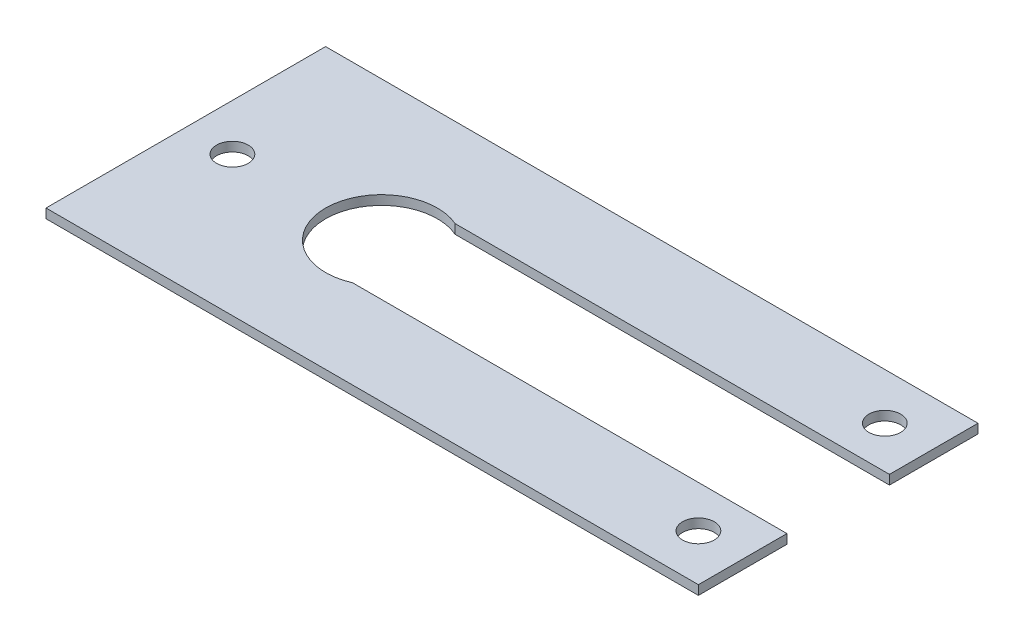
ISO-10303-21;
HEADER;
FILE_DESCRIPTION(('STEP AP214'),'2;1');
FILE_NAME('part.step','',(''),(''),'','','');
FILE_SCHEMA(('AUTOMOTIVE_DESIGN { 1 0 10303 214 1 1 1 1 }'));
ENDSEC;
DATA;
#1=APPLICATION_CONTEXT('core data for automotive mechanical design processes');
#2=APPLICATION_PROTOCOL_DEFINITION('international standard','automotive_design',2000,#1);
#3=PRODUCT_CONTEXT('',#1,'mechanical');
#4=PRODUCT('Part','Part','',(#3));
#5=PRODUCT_RELATED_PRODUCT_CATEGORY('part','',(#4));
#6=PRODUCT_DEFINITION_FORMATION('','',#4);
#7=PRODUCT_DEFINITION_CONTEXT('part definition',#1,'design');
#8=PRODUCT_DEFINITION('design','',#6,#7);
#9=PRODUCT_DEFINITION_SHAPE('','',#8);
#10=(LENGTH_UNIT() NAMED_UNIT(*) SI_UNIT(.MILLI.,.METRE.));
#11=(NAMED_UNIT(*) PLANE_ANGLE_UNIT() SI_UNIT($,.RADIAN.));
#12=(NAMED_UNIT(*) SI_UNIT($,.STERADIAN.) SOLID_ANGLE_UNIT());
#13=UNCERTAINTY_MEASURE_WITH_UNIT(LENGTH_MEASURE(1.E-05),#10,'distance_accuracy_value','');
#14=(GEOMETRIC_REPRESENTATION_CONTEXT(3) GLOBAL_UNCERTAINTY_ASSIGNED_CONTEXT((#13)) GLOBAL_UNIT_ASSIGNED_CONTEXT((#10,
#11,#12)) REPRESENTATION_CONTEXT('',''));
#15=CARTESIAN_POINT('',(0.,0.,0.));
#16=DIRECTION('',(0.,0.,1.));
#17=DIRECTION('',(1.,0.,0.));
#18=AXIS2_PLACEMENT_3D('',#15,#16,#17);
#19=CARTESIAN_POINT('',(35.,-1.,-5.5));
#20=DIRECTION('',(1.,0.,0.));
#21=DIRECTION('',(0.,0.,-1.));
#22=AXIS2_PLACEMENT_3D('',#19,#20,#21);
#23=PLANE('',#22);
#24=DIRECTION('',(0.,0.,-1.));
#25=VECTOR('',#24,1.);
#26=CARTESIAN_POINT('',(35.,0.,-5.5));
#27=LINE('',#26,#25);
#28=CARTESIAN_POINT('',(35.,0.,-5.5));
#29=VERTEX_POINT('',#28);
#30=CARTESIAN_POINT('',(35.,0.,-15.));
#31=VERTEX_POINT('',#30);
#32=EDGE_CURVE('E148',#29,#31,#27,.T.);
#33=ORIENTED_EDGE('',*,*,#32,.F.);
#34=DIRECTION('',(0.,1.,0.));
#35=VECTOR('',#34,1.);
#36=CARTESIAN_POINT('',(35.,-1.,-5.5));
#37=LINE('',#36,#35);
#38=CARTESIAN_POINT('',(35.,-1.,-5.5));
#39=VERTEX_POINT('',#38);
#40=EDGE_CURVE('E11',#39,#29,#37,.T.);
#41=ORIENTED_EDGE('',*,*,#40,.F.);
#42=DIRECTION('',(0.,0.,-1.));
#43=VECTOR('',#42,1.);
#44=CARTESIAN_POINT('',(35.,-1.,-5.5));
#45=LINE('',#44,#43);
#46=CARTESIAN_POINT('',(35.,-1.,-15.));
#47=VERTEX_POINT('',#46);
#48=EDGE_CURVE('E177',#39,#47,#45,.T.);
#49=ORIENTED_EDGE('',*,*,#48,.T.);
#50=DIRECTION('',(0.,1.,0.));
#51=VECTOR('',#50,1.);
#52=CARTESIAN_POINT('',(35.,-1.,-15.));
#53=LINE('',#52,#51);
#54=EDGE_CURVE('E48',#47,#31,#53,.T.);
#55=ORIENTED_EDGE('',*,*,#54,.T.);
#56=EDGE_LOOP('',(#33,#41,#49,#55));
#57=FACE_BOUND('',#56,.T.);
#58=ADVANCED_FACE('F45',(#57),#23,.T.);
#59=CARTESIAN_POINT('',(-11.6020842383436,-1.,-5.5));
#60=DIRECTION('',(0.,0.,1.));
#61=DIRECTION('',(1.,0.,0.));
#62=AXIS2_PLACEMENT_3D('',#59,#60,#61);
#63=PLANE('',#62);
#64=DIRECTION('',(1.,0.,0.));
#65=VECTOR('',#64,1.);
#66=CARTESIAN_POINT('',(-11.6020842383436,0.,-5.5));
#67=LINE('',#66,#65);
#68=CARTESIAN_POINT('',(-11.6020842383436,0.,-5.5));
#69=VERTEX_POINT('',#68);
#70=EDGE_CURVE('E174',#69,#29,#67,.T.);
#71=ORIENTED_EDGE('',*,*,#70,.F.);
#72=DIRECTION('',(0.,1.,0.));
#73=VECTOR('',#72,1.);
#74=CARTESIAN_POINT('',(-11.6020842383436,-1.,-5.5));
#75=LINE('',#74,#73);
#76=CARTESIAN_POINT('',(-11.6020842383436,-1.,-5.5));
#77=VERTEX_POINT('',#76);
#78=EDGE_CURVE('E55',#77,#69,#75,.T.);
#79=ORIENTED_EDGE('',*,*,#78,.F.);
#80=DIRECTION('',(1.,0.,0.));
#81=VECTOR('',#80,1.);
#82=CARTESIAN_POINT('',(-11.6020842383436,-1.,-5.5));
#83=LINE('',#82,#81);
#84=EDGE_CURVE('E134',#77,#39,#83,.T.);
#85=ORIENTED_EDGE('',*,*,#84,.T.);
#86=ORIENTED_EDGE('',*,*,#40,.T.);
#87=EDGE_LOOP('',(#71,#79,#85,#86));
#88=FACE_BOUND('',#87,.T.);
#89=ADVANCED_FACE('F195',(#88),#63,.T.);
#90=CARTESIAN_POINT('',(-14.,-1.,0.));
#91=DIRECTION('',(0.,1.,0.));
#92=DIRECTION('',(0.,0.,1.));
#93=AXIS2_PLACEMENT_3D('',#90,#91,#92);
#94=CYLINDRICAL_SURFACE('',#93,6.);
#95=CARTESIAN_POINT('',(-14.,0.,0.));
#96=DIRECTION('',(0.,-1.,0.));
#97=DIRECTION('',(0.,0.,1.));
#98=AXIS2_PLACEMENT_3D('',#95,#96,#97);
#99=CIRCLE('',#98,6.);
#100=CARTESIAN_POINT('',(-11.6020842383436,0.,5.5));
#101=VERTEX_POINT('',#100);
#102=EDGE_CURVE('E120',#101,#69,#99,.T.);
#103=ORIENTED_EDGE('',*,*,#102,.F.);
#104=DIRECTION('',(0.,1.,0.));
#105=VECTOR('',#104,1.);
#106=CARTESIAN_POINT('',(-11.6020842383436,-1.,5.5));
#107=LINE('',#106,#105);
#108=CARTESIAN_POINT('',(-11.6020842383436,-1.,5.5));
#109=VERTEX_POINT('',#108);
#110=EDGE_CURVE('E115',#109,#101,#107,.T.);
#111=ORIENTED_EDGE('',*,*,#110,.F.);
#112=CARTESIAN_POINT('',(-14.,-1.,0.));
#113=DIRECTION('',(0.,-1.,0.));
#114=DIRECTION('',(0.,0.,1.));
#115=AXIS2_PLACEMENT_3D('',#112,#113,#114);
#116=CIRCLE('',#115,6.);
#117=EDGE_CURVE('E118',#109,#77,#116,.T.);
#118=ORIENTED_EDGE('',*,*,#117,.T.);
#119=ORIENTED_EDGE('',*,*,#78,.T.);
#120=EDGE_LOOP('',(#103,#111,#118,#119));
#121=FACE_BOUND('',#120,.T.);
#122=ADVANCED_FACE('F117',(#121),#94,.F.);
#123=CARTESIAN_POINT('',(-11.6020842383436,-1.,5.5));
#124=DIRECTION('',(0.,0.,-1.));
#125=DIRECTION('',(-1.,0.,0.));
#126=AXIS2_PLACEMENT_3D('',#123,#124,#125);
#127=PLANE('',#126);
#128=DIRECTION('',(-1.,0.,0.));
#129=VECTOR('',#128,1.);
#130=CARTESIAN_POINT('',(-11.6020842383436,0.,5.5));
#131=LINE('',#130,#129);
#132=CARTESIAN_POINT('',(35.,0.,5.5));
#133=VERTEX_POINT('',#132);
#134=EDGE_CURVE('E169',#133,#101,#131,.T.);
#135=ORIENTED_EDGE('',*,*,#134,.F.);
#136=DIRECTION('',(0.,1.,0.));
#137=VECTOR('',#136,1.);
#138=CARTESIAN_POINT('',(35.,-1.,5.5));
#139=LINE('',#138,#137);
#140=CARTESIAN_POINT('',(35.,-1.,5.5));
#141=VERTEX_POINT('',#140);
#142=EDGE_CURVE('E126',#141,#133,#139,.T.);
#143=ORIENTED_EDGE('',*,*,#142,.F.);
#144=DIRECTION('',(-1.,0.,0.));
#145=VECTOR('',#144,1.);
#146=CARTESIAN_POINT('',(-11.6020842383436,-1.,5.5));
#147=LINE('',#146,#145);
#148=EDGE_CURVE('E132',#141,#109,#147,.T.);
#149=ORIENTED_EDGE('',*,*,#148,.T.);
#150=ORIENTED_EDGE('',*,*,#110,.T.);
#151=EDGE_LOOP('',(#135,#143,#149,#150));
#152=FACE_BOUND('',#151,.T.);
#153=ADVANCED_FACE('F137',(#152),#127,.T.);
#154=CARTESIAN_POINT('',(35.,-1.,15.));
#155=DIRECTION('',(1.,0.,0.));
#156=DIRECTION('',(0.,0.,-1.));
#157=AXIS2_PLACEMENT_3D('',#154,#155,#156);
#158=PLANE('',#157);
#159=DIRECTION('',(0.,0.,-1.));
#160=VECTOR('',#159,1.);
#161=CARTESIAN_POINT('',(35.,0.,15.));
#162=LINE('',#161,#160);
#163=CARTESIAN_POINT('',(35.,0.,15.));
#164=VERTEX_POINT('',#163);
#165=EDGE_CURVE('E165',#164,#133,#162,.T.);
#166=ORIENTED_EDGE('',*,*,#165,.F.);
#167=DIRECTION('',(0.,1.,0.));
#168=VECTOR('',#167,1.);
#169=CARTESIAN_POINT('',(35.,-1.,15.));
#170=LINE('',#169,#168);
#171=CARTESIAN_POINT('',(35.,-1.,15.));
#172=VERTEX_POINT('',#171);
#173=EDGE_CURVE('E183',#172,#164,#170,.T.);
#174=ORIENTED_EDGE('',*,*,#173,.F.);
#175=DIRECTION('',(0.,0.,-1.));
#176=VECTOR('',#175,1.);
#177=CARTESIAN_POINT('',(35.,-1.,15.));
#178=LINE('',#177,#176);
#179=EDGE_CURVE('E139',#172,#141,#178,.T.);
#180=ORIENTED_EDGE('',*,*,#179,.T.);
#181=ORIENTED_EDGE('',*,*,#142,.T.);
#182=EDGE_LOOP('',(#166,#174,#180,#181));
#183=FACE_BOUND('',#182,.T.);
#184=ADVANCED_FACE('F208',(#183),#158,.T.);
#185=CARTESIAN_POINT('',(-35.,-1.,15.));
#186=DIRECTION('',(0.,0.,1.));
#187=DIRECTION('',(1.,0.,0.));
#188=AXIS2_PLACEMENT_3D('',#185,#186,#187);
#189=PLANE('',#188);
#190=DIRECTION('',(1.,0.,0.));
#191=VECTOR('',#190,1.);
#192=CARTESIAN_POINT('',(-35.,0.,15.));
#193=LINE('',#192,#191);
#194=CARTESIAN_POINT('',(-35.,0.,15.));
#195=VERTEX_POINT('',#194);
#196=EDGE_CURVE('E161',#195,#164,#193,.T.);
#197=ORIENTED_EDGE('',*,*,#196,.F.);
#198=DIRECTION('',(0.,1.,0.));
#199=VECTOR('',#198,1.);
#200=CARTESIAN_POINT('',(-35.,-1.,15.));
#201=LINE('',#200,#199);
#202=CARTESIAN_POINT('',(-35.,-1.,15.));
#203=VERTEX_POINT('',#202);
#204=EDGE_CURVE('E186',#203,#195,#201,.T.);
#205=ORIENTED_EDGE('',*,*,#204,.F.);
#206=DIRECTION('',(1.,0.,0.));
#207=VECTOR('',#206,1.);
#208=CARTESIAN_POINT('',(-35.,-1.,15.));
#209=LINE('',#208,#207);
#210=EDGE_CURVE('E142',#203,#172,#209,.T.);
#211=ORIENTED_EDGE('',*,*,#210,.T.);
#212=ORIENTED_EDGE('',*,*,#173,.T.);
#213=EDGE_LOOP('',(#197,#205,#211,#212));
#214=FACE_BOUND('',#213,.T.);
#215=ADVANCED_FACE('F211',(#214),#189,.T.);
#216=CARTESIAN_POINT('',(-35.,-1.,15.));
#217=DIRECTION('',(-1.,0.,0.));
#218=DIRECTION('',(0.,0.,1.));
#219=AXIS2_PLACEMENT_3D('',#216,#217,#218);
#220=PLANE('',#219);
#221=DIRECTION('',(0.,0.,1.));
#222=VECTOR('',#221,1.);
#223=CARTESIAN_POINT('',(-35.,0.,15.));
#224=LINE('',#223,#222);
#225=CARTESIAN_POINT('',(-35.,0.,-15.));
#226=VERTEX_POINT('',#225);
#227=EDGE_CURVE('E157',#226,#195,#224,.T.);
#228=ORIENTED_EDGE('',*,*,#227,.F.);
#229=DIRECTION('',(0.,1.,0.));
#230=VECTOR('',#229,1.);
#231=CARTESIAN_POINT('',(-35.,-1.,-15.));
#232=LINE('',#231,#230);
#233=CARTESIAN_POINT('',(-35.,-1.,-15.));
#234=VERTEX_POINT('',#233);
#235=EDGE_CURVE('E188',#234,#226,#232,.T.);
#236=ORIENTED_EDGE('',*,*,#235,.F.);
#237=DIRECTION('',(0.,0.,1.));
#238=VECTOR('',#237,1.);
#239=CARTESIAN_POINT('',(-35.,-1.,15.));
#240=LINE('',#239,#238);
#241=EDGE_CURVE('E275',#234,#203,#240,.T.);
#242=ORIENTED_EDGE('',*,*,#241,.T.);
#243=ORIENTED_EDGE('',*,*,#204,.T.);
#244=EDGE_LOOP('',(#228,#236,#242,#243));
#245=FACE_BOUND('',#244,.T.);
#246=ADVANCED_FACE('F215',(#245),#220,.T.);
#247=CARTESIAN_POINT('',(-35.,-1.,-15.));
#248=DIRECTION('',(0.,0.,-1.));
#249=DIRECTION('',(-1.,0.,0.));
#250=AXIS2_PLACEMENT_3D('',#247,#248,#249);
#251=PLANE('',#250);
#252=DIRECTION('',(-1.,0.,0.));
#253=VECTOR('',#252,1.);
#254=CARTESIAN_POINT('',(-35.,0.,-15.));
#255=LINE('',#254,#253);
#256=EDGE_CURVE('E152',#31,#226,#255,.T.);
#257=ORIENTED_EDGE('',*,*,#256,.F.);
#258=ORIENTED_EDGE('',*,*,#54,.F.);
#259=DIRECTION('',(-1.,0.,0.));
#260=VECTOR('',#259,1.);
#261=CARTESIAN_POINT('',(-35.,-1.,-15.));
#262=LINE('',#261,#260);
#263=EDGE_CURVE('E272',#47,#234,#262,.T.);
#264=ORIENTED_EDGE('',*,*,#263,.T.);
#265=ORIENTED_EDGE('',*,*,#235,.T.);
#266=EDGE_LOOP('',(#257,#258,#264,#265));
#267=FACE_BOUND('',#266,.T.);
#268=ADVANCED_FACE('F192',(#267),#251,.T.);
#269=CARTESIAN_POINT('',(-14.,-1.,0.));
#270=DIRECTION('',(0.,1.,0.));
#271=DIRECTION('',(0.,0.,1.));
#272=AXIS2_PLACEMENT_3D('',#269,#270,#271);
#273=PLANE('',#272);
#274=CARTESIAN_POINT('',(30.,-1.,10.));
#275=DIRECTION('',(0.,1.,0.));
#276=DIRECTION('',(0.,0.,-1.));
#277=AXIS2_PLACEMENT_3D('',#274,#275,#276);
#278=CIRCLE('',#277,1.7);
#279=CARTESIAN_POINT('',(30.,-1.,8.3));
#280=VERTEX_POINT('',#279);
#281=EDGE_CURVE('E246',#280,#280,#278,.T.);
#282=ORIENTED_EDGE('',*,*,#281,.T.);
#283=EDGE_LOOP('',(#282));
#284=FACE_BOUND('',#283,.T.);
#285=CARTESIAN_POINT('',(-30.,-1.,0.));
#286=DIRECTION('',(0.,1.,0.));
#287=DIRECTION('',(0.,0.,1.));
#288=AXIS2_PLACEMENT_3D('',#285,#286,#287);
#289=CIRCLE('',#288,1.7);
#290=CARTESIAN_POINT('',(-30.,-1.,1.7));
#291=VERTEX_POINT('',#290);
#292=EDGE_CURVE('E256',#291,#291,#289,.T.);
#293=ORIENTED_EDGE('',*,*,#292,.T.);
#294=EDGE_LOOP('',(#293));
#295=FACE_BOUND('',#294,.T.);
#296=CARTESIAN_POINT('',(30.,-1.,-10.));
#297=DIRECTION('',(0.,1.,0.));
#298=DIRECTION('',(0.,0.,1.));
#299=AXIS2_PLACEMENT_3D('',#296,#297,#298);
#300=CIRCLE('',#299,1.7);
#301=CARTESIAN_POINT('',(30.,-1.,-8.3));
#302=VERTEX_POINT('',#301);
#303=EDGE_CURVE('E153',#302,#302,#300,.T.);
#304=ORIENTED_EDGE('',*,*,#303,.T.);
#305=EDGE_LOOP('',(#304));
#306=FACE_BOUND('',#305,.T.);
#307=ORIENTED_EDGE('',*,*,#48,.F.);
#308=ORIENTED_EDGE('',*,*,#84,.F.);
#309=ORIENTED_EDGE('',*,*,#117,.F.);
#310=ORIENTED_EDGE('',*,*,#148,.F.);
#311=ORIENTED_EDGE('',*,*,#179,.F.);
#312=ORIENTED_EDGE('',*,*,#210,.F.);
#313=ORIENTED_EDGE('',*,*,#241,.F.);
#314=ORIENTED_EDGE('',*,*,#263,.F.);
#315=EDGE_LOOP('',(#307,#308,#309,#310,#311,#312,#313,#314));
#316=FACE_BOUND('',#315,.T.);
#317=ADVANCED_FACE('F130',(#284,#295,#306,#316),#273,.F.);
#318=CARTESIAN_POINT('',(-14.,0.,0.));
#319=DIRECTION('',(0.,1.,0.));
#320=DIRECTION('',(0.,0.,1.));
#321=AXIS2_PLACEMENT_3D('',#318,#319,#320);
#322=PLANE('',#321);
#323=CARTESIAN_POINT('',(30.,0.,10.));
#324=DIRECTION('',(0.,1.,0.));
#325=DIRECTION('',(0.,0.,-1.));
#326=AXIS2_PLACEMENT_3D('',#323,#324,#325);
#327=CIRCLE('',#326,1.7);
#328=CARTESIAN_POINT('',(30.,0.,8.3));
#329=VERTEX_POINT('',#328);
#330=EDGE_CURVE('E249',#329,#329,#327,.T.);
#331=ORIENTED_EDGE('',*,*,#330,.F.);
#332=EDGE_LOOP('',(#331));
#333=FACE_BOUND('',#332,.T.);
#334=CARTESIAN_POINT('',(-30.,0.,0.));
#335=DIRECTION('',(0.,1.,0.));
#336=DIRECTION('',(0.,0.,1.));
#337=AXIS2_PLACEMENT_3D('',#334,#335,#336);
#338=CIRCLE('',#337,1.7);
#339=CARTESIAN_POINT('',(-30.,0.,1.7));
#340=VERTEX_POINT('',#339);
#341=EDGE_CURVE('E253',#340,#340,#338,.T.);
#342=ORIENTED_EDGE('',*,*,#341,.F.);
#343=EDGE_LOOP('',(#342));
#344=FACE_BOUND('',#343,.T.);
#345=CARTESIAN_POINT('',(30.,0.,-10.));
#346=DIRECTION('',(0.,1.,0.));
#347=DIRECTION('',(0.,0.,1.));
#348=AXIS2_PLACEMENT_3D('',#345,#346,#347);
#349=CIRCLE('',#348,1.7);
#350=CARTESIAN_POINT('',(30.,0.,-8.3));
#351=VERTEX_POINT('',#350);
#352=EDGE_CURVE('E260',#351,#351,#349,.T.);
#353=ORIENTED_EDGE('',*,*,#352,.F.);
#354=EDGE_LOOP('',(#353));
#355=FACE_BOUND('',#354,.T.);
#356=ORIENTED_EDGE('',*,*,#32,.T.);
#357=ORIENTED_EDGE('',*,*,#256,.T.);
#358=ORIENTED_EDGE('',*,*,#227,.T.);
#359=ORIENTED_EDGE('',*,*,#196,.T.);
#360=ORIENTED_EDGE('',*,*,#165,.T.);
#361=ORIENTED_EDGE('',*,*,#134,.T.);
#362=ORIENTED_EDGE('',*,*,#102,.T.);
#363=ORIENTED_EDGE('',*,*,#70,.T.);
#364=EDGE_LOOP('',(#356,#357,#358,#359,#360,#361,#362,#363));
#365=FACE_BOUND('',#364,.T.);
#366=ADVANCED_FACE('F194',(#333,#344,#355,#365),#322,.T.);
#367=CARTESIAN_POINT('',(30.,-1.,-10.));
#368=DIRECTION('',(0.,1.,0.));
#369=DIRECTION('',(0.,0.,1.));
#370=AXIS2_PLACEMENT_3D('',#367,#368,#369);
#371=CYLINDRICAL_SURFACE('',#370,1.7);
#372=ORIENTED_EDGE('',*,*,#303,.F.);
#373=EDGE_LOOP('',(#372));
#374=FACE_BOUND('',#373,.T.);
#375=ORIENTED_EDGE('',*,*,#352,.T.);
#376=EDGE_LOOP('',(#375));
#377=FACE_BOUND('',#376,.T.);
#378=ADVANCED_FACE('F227',(#374,#377),#371,.F.);
#379=CARTESIAN_POINT('',(-30.,-1.,0.));
#380=DIRECTION('',(0.,1.,0.));
#381=DIRECTION('',(0.,0.,1.));
#382=AXIS2_PLACEMENT_3D('',#379,#380,#381);
#383=CYLINDRICAL_SURFACE('',#382,1.7);
#384=ORIENTED_EDGE('',*,*,#292,.F.);
#385=EDGE_LOOP('',(#384));
#386=FACE_BOUND('',#385,.T.);
#387=ORIENTED_EDGE('',*,*,#341,.T.);
#388=EDGE_LOOP('',(#387));
#389=FACE_BOUND('',#388,.T.);
#390=ADVANCED_FACE('F234',(#386,#389),#383,.F.);
#391=CARTESIAN_POINT('',(30.,-1.,10.));
#392=DIRECTION('',(0.,1.,0.));
#393=DIRECTION('',(0.,0.,1.));
#394=AXIS2_PLACEMENT_3D('',#391,#392,#393);
#395=CYLINDRICAL_SURFACE('',#394,1.7);
#396=ORIENTED_EDGE('',*,*,#281,.F.);
#397=EDGE_LOOP('',(#396));
#398=FACE_BOUND('',#397,.T.);
#399=ORIENTED_EDGE('',*,*,#330,.T.);
#400=EDGE_LOOP('',(#399));
#401=FACE_BOUND('',#400,.T.);
#402=ADVANCED_FACE('F238',(#398,#401),#395,.F.);
#403=CLOSED_SHELL('',(#58,#89,#122,#153,#184,#215,#246,#268,#317,#366,#378,#390,#402));
#404=MANIFOLD_SOLID_BREP('B2',#403);
#405=ADVANCED_BREP_SHAPE_REPRESENTATION('',(#18,#404),#14);
#406=SHAPE_DEFINITION_REPRESENTATION(#9,#405);
ENDSEC;
END-ISO-10303-21;
